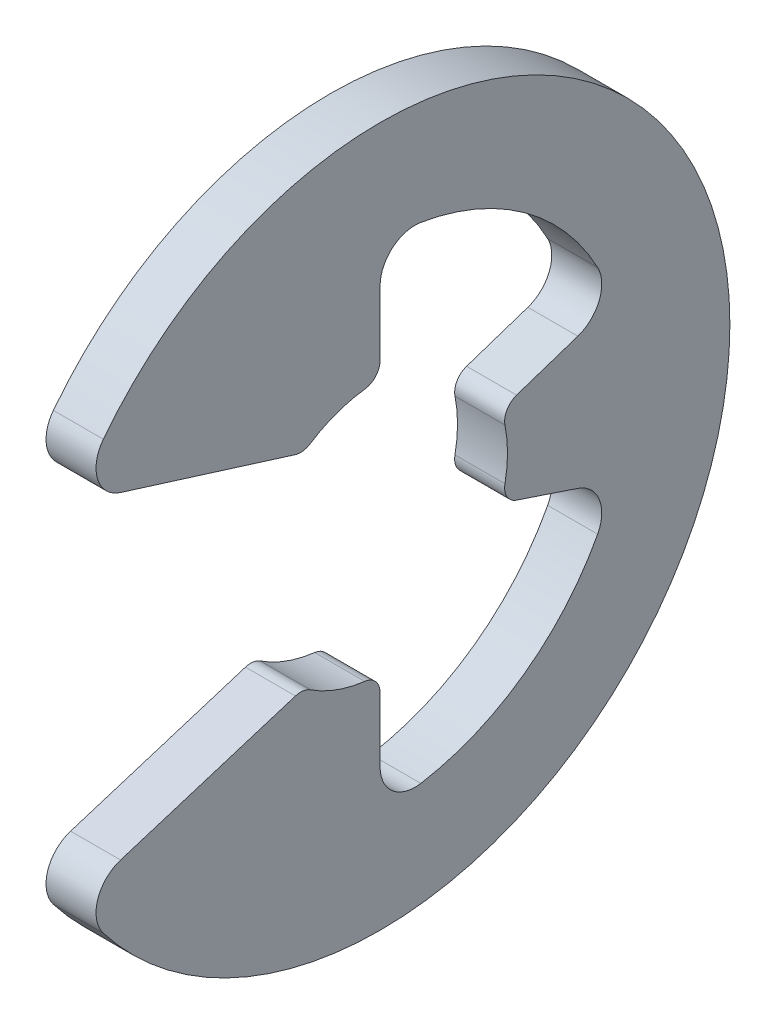
ISO-10303-21;
HEADER;
FILE_DESCRIPTION(('STEP AP214'),'2;1');
FILE_NAME('part.step','',(''),(''),'','','');
FILE_SCHEMA(('AUTOMOTIVE_DESIGN { 1 0 10303 214 1 1 1 1 }'));
ENDSEC;
DATA;
#1=APPLICATION_CONTEXT('core data for automotive mechanical design processes');
#2=APPLICATION_PROTOCOL_DEFINITION('international standard','automotive_design',2000,#1);
#3=PRODUCT_CONTEXT('',#1,'mechanical');
#4=PRODUCT('Part','Part','',(#3));
#5=PRODUCT_RELATED_PRODUCT_CATEGORY('part','',(#4));
#6=PRODUCT_DEFINITION_FORMATION('','',#4);
#7=PRODUCT_DEFINITION_CONTEXT('part definition',#1,'design');
#8=PRODUCT_DEFINITION('design','',#6,#7);
#9=PRODUCT_DEFINITION_SHAPE('','',#8);
#10=(LENGTH_UNIT() NAMED_UNIT(*) SI_UNIT(.MILLI.,.METRE.));
#11=(NAMED_UNIT(*) PLANE_ANGLE_UNIT() SI_UNIT($,.RADIAN.));
#12=(NAMED_UNIT(*) SI_UNIT($,.STERADIAN.) SOLID_ANGLE_UNIT());
#13=UNCERTAINTY_MEASURE_WITH_UNIT(LENGTH_MEASURE(1.E-05),#10,'distance_accuracy_value','');
#14=(GEOMETRIC_REPRESENTATION_CONTEXT(3) GLOBAL_UNCERTAINTY_ASSIGNED_CONTEXT((#13)) GLOBAL_UNIT_ASSIGNED_CONTEXT((#10,
#11,#12)) REPRESENTATION_CONTEXT('',''));
#15=CARTESIAN_POINT('',(0.,0.,0.));
#16=DIRECTION('',(0.,0.,1.));
#17=DIRECTION('',(1.,0.,0.));
#18=AXIS2_PLACEMENT_3D('',#15,#16,#17);
#19=CARTESIAN_POINT('',(0.127,0.,0.));
#20=DIRECTION('',(-1.,0.,0.));
#21=DIRECTION('',(0.,0.,1.));
#22=AXIS2_PLACEMENT_3D('',#19,#20,#21);
#23=CYLINDRICAL_SURFACE('',#22,0.6477);
#24=CARTESIAN_POINT('',(0.127,0.,0.));
#25=DIRECTION('',(-1.,0.,0.));
#26=DIRECTION('',(0.,0.,-1.));
#27=AXIS2_PLACEMENT_3D('',#24,#25,#26);
#28=CIRCLE('',#27,0.6477);
#29=CARTESIAN_POINT('',(0.127,0.129164315793818,-0.63469037295796));
#30=VERTEX_POINT('',#29);
#31=CARTESIAN_POINT('',(0.127,-0.129164315793818,-0.63469037295796));
#32=VERTEX_POINT('',#31);
#33=EDGE_CURVE('E241',#30,#32,#28,.T.);
#34=ORIENTED_EDGE('',*,*,#33,.F.);
#35=DIRECTION('',(-1.,0.,0.));
#36=VECTOR('',#35,1.);
#37=CARTESIAN_POINT('',(0.127,0.129164315793818,-0.634690372957961));
#38=LINE('',#37,#36);
#39=CARTESIAN_POINT('',(-0.127,0.129164315793818,-0.63469037295796));
#40=VERTEX_POINT('',#39);
#41=EDGE_CURVE('E355',#30,#40,#38,.T.);
#42=ORIENTED_EDGE('',*,*,#41,.T.);
#43=CARTESIAN_POINT('',(-0.127,0.,0.));
#44=DIRECTION('',(-1.,0.,0.));
#45=DIRECTION('',(0.,0.,-1.));
#46=AXIS2_PLACEMENT_3D('',#43,#44,#45);
#47=CIRCLE('',#46,0.6477);
#48=CARTESIAN_POINT('',(-0.127,-0.129164315793818,-0.63469037295796));
#49=VERTEX_POINT('',#48);
#50=EDGE_CURVE('E414',#40,#49,#47,.T.);
#51=ORIENTED_EDGE('',*,*,#50,.T.);
#52=DIRECTION('',(-1.,0.,0.));
#53=VECTOR('',#52,1.);
#54=CARTESIAN_POINT('',(0.127,-0.129164315793818,-0.63469037295796));
#55=LINE('',#54,#53);
#56=EDGE_CURVE('E55',#49,#32,#55,.F.);
#57=ORIENTED_EDGE('',*,*,#56,.T.);
#58=EDGE_LOOP('',(#34,#42,#51,#57));
#59=FACE_BOUND('',#58,.T.);
#60=ADVANCED_FACE('F32',(#59),#23,.F.);
#61=CARTESIAN_POINT('',(0.127,-0.204820724049106,-0.614462172147318));
#62=DIRECTION('',(0.,0.948683298050514,-0.316227766016838));
#63=DIRECTION('',(0.,0.316227766016838,0.948683298050514));
#64=AXIS2_PLACEMENT_3D('',#61,#62,#63);
#65=PLANE('',#64);
#66=DIRECTION('',(0.,-0.316227766016838,-0.948683298050514));
#67=VECTOR('',#66,1.);
#68=CARTESIAN_POINT('',(0.127,-0.204820724049106,-0.614462172147318));
#69=LINE('',#68,#67);
#70=CARTESIAN_POINT('',(0.127,-0.231230696491621,-0.693692089474862));
#71=VERTEX_POINT('',#70);
#72=CARTESIAN_POINT('',(0.127,-0.33499811314175,-1.00499433942525));
#73=VERTEX_POINT('',#72);
#74=EDGE_CURVE('E243',#71,#73,#69,.T.);
#75=ORIENTED_EDGE('',*,*,#74,.F.);
#76=DIRECTION('',(-1.,0.,0.));
#77=VECTOR('',#76,1.);
#78=CARTESIAN_POINT('',(0.127,-0.231230696491621,-0.693692089474862));
#79=LINE('',#78,#77);
#80=CARTESIAN_POINT('',(-0.127,-0.231230696491621,-0.693692089474862));
#81=VERTEX_POINT('',#80);
#82=EDGE_CURVE('E360',#71,#81,#79,.T.);
#83=ORIENTED_EDGE('',*,*,#82,.T.);
#84=DIRECTION('',(0.,-0.316227766016838,-0.948683298050514));
#85=VECTOR('',#84,1.);
#86=CARTESIAN_POINT('',(-0.127,-0.204820724049106,-0.614462172147318));
#87=LINE('',#86,#85);
#88=CARTESIAN_POINT('',(-0.127,-0.33499811314175,-1.00499433942525));
#89=VERTEX_POINT('',#88);
#90=EDGE_CURVE('E416',#81,#89,#87,.T.);
#91=ORIENTED_EDGE('',*,*,#90,.T.);
#92=DIRECTION('',(1.,0.,0.));
#93=VECTOR('',#92,1.);
#94=CARTESIAN_POINT('',(0.127,-0.33499811314175,-1.00499433942525));
#95=LINE('',#94,#93);
#96=EDGE_CURVE('E289',#89,#73,#95,.T.);
#97=ORIENTED_EDGE('',*,*,#96,.T.);
#98=EDGE_LOOP('',(#75,#83,#91,#97));
#99=FACE_BOUND('',#98,.T.);
#100=ADVANCED_FACE('F452',(#99),#65,.F.);
#101=CARTESIAN_POINT('',(0.127,0.,0.));
#102=DIRECTION('',(-1.,0.,0.));
#103=DIRECTION('',(0.,0.,1.));
#104=AXIS2_PLACEMENT_3D('',#101,#102,#103);
#105=CYLINDRICAL_SURFACE('',#104,1.25197419354839);
#106=CARTESIAN_POINT('',(-0.127,0.,0.));
#107=DIRECTION('',(-1.,0.,0.));
#108=DIRECTION('',(0.,0.,-1.));
#109=AXIS2_PLACEMENT_3D('',#106,#107,#108);
#110=CIRCLE('',#109,1.25197419354839);
#111=CARTESIAN_POINT('',(-0.127,-0.587043384745752,-1.10581166829501));
#112=VERTEX_POINT('',#111);
#113=CARTESIAN_POINT('',(-0.127,-1.23470447861396,-0.207229900839054));
#114=VERTEX_POINT('',#113);
#115=EDGE_CURVE('E418',#112,#114,#110,.T.);
#116=ORIENTED_EDGE('',*,*,#115,.T.);
#117=DIRECTION('',(-1.,0.,0.));
#118=VECTOR('',#117,1.);
#119=CARTESIAN_POINT('',(0.127,-1.23470447861396,-0.207229900839054));
#120=LINE('',#119,#118);
#121=CARTESIAN_POINT('',(0.127,-1.23470447861396,-0.207229900839054));
#122=VERTEX_POINT('',#121);
#123=EDGE_CURVE('E287',#114,#122,#120,.F.);
#124=ORIENTED_EDGE('',*,*,#123,.T.);
#125=CARTESIAN_POINT('',(0.127,0.,0.));
#126=DIRECTION('',(-1.,0.,0.));
#127=DIRECTION('',(0.,0.,-1.));
#128=AXIS2_PLACEMENT_3D('',#125,#126,#127);
#129=CIRCLE('',#128,1.25197419354839);
#130=CARTESIAN_POINT('',(0.127,-0.587043384745752,-1.10581166829501));
#131=VERTEX_POINT('',#130);
#132=EDGE_CURVE('E245',#131,#122,#129,.T.);
#133=ORIENTED_EDGE('',*,*,#132,.F.);
#134=DIRECTION('',(-1.,0.,0.));
#135=VECTOR('',#134,1.);
#136=CARTESIAN_POINT('',(0.127,-0.587043384745752,-1.10581166829501));
#137=LINE('',#136,#135);
#138=EDGE_CURVE('E284',#131,#112,#137,.T.);
#139=ORIENTED_EDGE('',*,*,#138,.T.);
#140=EDGE_LOOP('',(#116,#124,#133,#139));
#141=FACE_BOUND('',#140,.T.);
#142=ADVANCED_FACE('F457',(#141),#105,.F.);
#143=CARTESIAN_POINT('',(0.127,-1.25197419354839,0.));
#144=DIRECTION('',(0.,0.,1.));
#145=DIRECTION('',(0.,-1.,0.));
#146=AXIS2_PLACEMENT_3D('',#143,#144,#145);
#147=PLANE('',#146);
#148=DIRECTION('',(0.,1.,0.));
#149=VECTOR('',#148,1.);
#150=CARTESIAN_POINT('',(-0.127,-1.25197419354839,0.));
#151=LINE('',#150,#149);
#152=CARTESIAN_POINT('',(-0.127,-1.05935704938672,0.));
#153=VERTEX_POINT('',#152);
#154=CARTESIAN_POINT('',(-0.127,-0.731215665860627,0.));
#155=VERTEX_POINT('',#154);
#156=EDGE_CURVE('E423',#153,#155,#151,.T.);
#157=ORIENTED_EDGE('',*,*,#156,.T.);
#158=DIRECTION('',(-1.,0.,0.));
#159=VECTOR('',#158,1.);
#160=CARTESIAN_POINT('',(0.127,-0.731215665860627,0.));
#161=LINE('',#160,#159);
#162=CARTESIAN_POINT('',(0.127,-0.731215665860627,0.));
#163=VERTEX_POINT('',#162);
#164=EDGE_CURVE('E338',#155,#163,#161,.F.);
#165=ORIENTED_EDGE('',*,*,#164,.T.);
#166=DIRECTION('',(0.,1.,0.));
#167=VECTOR('',#166,1.);
#168=CARTESIAN_POINT('',(0.127,-1.25197419354839,0.));
#169=LINE('',#168,#167);
#170=CARTESIAN_POINT('',(0.127,-1.05935704938672,0.));
#171=VERTEX_POINT('',#170);
#172=EDGE_CURVE('E248',#171,#163,#169,.T.);
#173=ORIENTED_EDGE('',*,*,#172,.F.);
#174=DIRECTION('',(1.,0.,0.));
#175=VECTOR('',#174,1.);
#176=CARTESIAN_POINT('',(-0.127,-1.05935704938672,0.));
#177=LINE('',#176,#175);
#178=EDGE_CURVE('E281',#171,#153,#177,.F.);
#179=ORIENTED_EDGE('',*,*,#178,.T.);
#180=EDGE_LOOP('',(#157,#165,#173,#179));
#181=FACE_BOUND('',#180,.T.);
#182=ADVANCED_FACE('F463',(#181),#147,.F.);
#183=CARTESIAN_POINT('',(0.127,0.,0.));
#184=DIRECTION('',(-1.,0.,0.));
#185=DIRECTION('',(0.,0.,1.));
#186=AXIS2_PLACEMENT_3D('',#183,#184,#185);
#187=CYLINDRICAL_SURFACE('',#186,0.6477);
#188=CARTESIAN_POINT('',(0.127,0.,0.));
#189=DIRECTION('',(-1.,0.,0.));
#190=DIRECTION('',(0.,0.,-1.));
#191=AXIS2_PLACEMENT_3D('',#188,#189,#190);
#192=CIRCLE('',#191,0.6477);
#193=CARTESIAN_POINT('',(0.127,-0.642965499291241,0.0781706896551725));
#194=VERTEX_POINT('',#193);
#195=CARTESIAN_POINT('',(0.127,-0.541693915280569,0.355081669687423));
#196=VERTEX_POINT('',#195);
#197=EDGE_CURVE('E251',#194,#196,#192,.T.);
#198=ORIENTED_EDGE('',*,*,#197,.F.);
#199=DIRECTION('',(-1.,0.,0.));
#200=VECTOR('',#199,1.);
#201=CARTESIAN_POINT('',(0.127,-0.642965499291241,0.0781706896551726));
#202=LINE('',#201,#200);
#203=CARTESIAN_POINT('',(-0.127,-0.642965499291241,0.0781706896551725));
#204=VERTEX_POINT('',#203);
#205=EDGE_CURVE('E323',#194,#204,#202,.T.);
#206=ORIENTED_EDGE('',*,*,#205,.T.);
#207=CARTESIAN_POINT('',(-0.127,0.,0.));
#208=DIRECTION('',(-1.,0.,0.));
#209=DIRECTION('',(0.,0.,-1.));
#210=AXIS2_PLACEMENT_3D('',#207,#208,#209);
#211=CIRCLE('',#210,0.6477);
#212=CARTESIAN_POINT('',(-0.127,-0.541693915280569,0.355081669687423));
#213=VERTEX_POINT('',#212);
#214=EDGE_CURVE('E227',#204,#213,#211,.T.);
#215=ORIENTED_EDGE('',*,*,#214,.T.);
#216=DIRECTION('',(-1.,0.,0.));
#217=VECTOR('',#216,1.);
#218=CARTESIAN_POINT('',(0.127,-0.541693915280569,0.355081669687423));
#219=LINE('',#218,#217);
#220=EDGE_CURVE('E321',#213,#196,#219,.F.);
#221=ORIENTED_EDGE('',*,*,#220,.T.);
#222=EDGE_LOOP('',(#198,#206,#215,#221));
#223=FACE_BOUND('',#222,.T.);
#224=ADVANCED_FACE('F429',(#223),#187,.F.);
#225=CARTESIAN_POINT('',(0.127,-0.51816,0.38862));
#226=DIRECTION('',(0.,-0.954513538836348,-0.29816757734219));
#227=DIRECTION('',(0.,0.29816757734219,-0.954513538836348));
#228=AXIS2_PLACEMENT_3D('',#225,#226,#227);
#229=PLANE('',#228);
#230=DIRECTION('',(0.,-0.29816757734219,0.954513538836348));
#231=VECTOR('',#230,1.);
#232=CARTESIAN_POINT('',(0.127,-0.51816,0.38862));
#233=LINE('',#232,#231);
#234=CARTESIAN_POINT('',(0.127,-0.531187806912605,0.430325467074162));
#235=VERTEX_POINT('',#234);
#236=CARTESIAN_POINT('',(0.127,-0.808834054460641,1.31914478356062));
#237=VERTEX_POINT('',#236);
#238=EDGE_CURVE('E254',#235,#237,#233,.T.);
#239=ORIENTED_EDGE('',*,*,#238,.F.);
#240=DIRECTION('',(-1.,0.,0.));
#241=VECTOR('',#240,1.);
#242=CARTESIAN_POINT('',(0.127,-0.531187806912605,0.430325467074162));
#243=LINE('',#242,#241);
#244=CARTESIAN_POINT('',(-0.127,-0.531187806912605,0.430325467074162));
#245=VERTEX_POINT('',#244);
#246=EDGE_CURVE('E351',#235,#245,#243,.T.);
#247=ORIENTED_EDGE('',*,*,#246,.T.);
#248=DIRECTION('',(0.,-0.29816757734219,0.954513538836348));
#249=VECTOR('',#248,1.);
#250=CARTESIAN_POINT('',(-0.127,-0.51816,0.38862));
#251=LINE('',#250,#249);
#252=CARTESIAN_POINT('',(-0.127,-0.808834054460641,1.31914478356062));
#253=VERTEX_POINT('',#252);
#254=EDGE_CURVE('E222',#245,#253,#251,.T.);
#255=ORIENTED_EDGE('',*,*,#254,.T.);
#256=DIRECTION('',(-1.,0.,0.));
#257=VECTOR('',#256,1.);
#258=CARTESIAN_POINT('',(0.127,-0.808834054460641,1.31914478356062));
#259=LINE('',#258,#257);
#260=EDGE_CURVE('E202',#253,#237,#259,.F.);
#261=ORIENTED_EDGE('',*,*,#260,.T.);
#262=EDGE_LOOP('',(#239,#247,#255,#261));
#263=FACE_BOUND('',#262,.T.);
#264=ADVANCED_FACE('F437',(#263),#229,.F.);
#265=CARTESIAN_POINT('',(0.127,0.,0.));
#266=DIRECTION('',(-1.,0.,0.));
#267=DIRECTION('',(0.,0.,1.));
#268=AXIS2_PLACEMENT_3D('',#265,#266,#267);
#269=CYLINDRICAL_SURFACE('',#268,1.778);
#270=CARTESIAN_POINT('',(0.127,0.,0.));
#271=DIRECTION('',(1.,0.,0.));
#272=DIRECTION('',(0.,0.,-1.));
#273=AXIS2_PLACEMENT_3D('',#270,#271,#272);
#274=CIRCLE('',#273,1.778);
#275=CARTESIAN_POINT('',(0.127,-1.08727395740638,1.40681176478798));
#276=VERTEX_POINT('',#275);
#277=CARTESIAN_POINT('',(0.127,1.08727395740638,1.40681176478798));
#278=VERTEX_POINT('',#277);
#279=EDGE_CURVE('E215',#276,#278,#274,.T.);
#280=ORIENTED_EDGE('',*,*,#279,.F.);
#281=DIRECTION('',(-1.,0.,0.));
#282=VECTOR('',#281,1.);
#283=CARTESIAN_POINT('',(0.127,-1.08727395740638,1.40681176478798));
#284=LINE('',#283,#282);
#285=CARTESIAN_POINT('',(-0.127,-1.08727395740638,1.40681176478798));
#286=VERTEX_POINT('',#285);
#287=EDGE_CURVE('E200',#276,#286,#284,.T.);
#288=ORIENTED_EDGE('',*,*,#287,.T.);
#289=CARTESIAN_POINT('',(-0.127,0.,0.));
#290=DIRECTION('',(1.,0.,0.));
#291=DIRECTION('',(0.,0.,-1.));
#292=AXIS2_PLACEMENT_3D('',#289,#290,#291);
#293=CIRCLE('',#292,1.778);
#294=CARTESIAN_POINT('',(-0.127,1.08727395740638,1.40681176478798));
#295=VERTEX_POINT('',#294);
#296=EDGE_CURVE('E212',#286,#295,#293,.T.);
#297=ORIENTED_EDGE('',*,*,#296,.T.);
#298=DIRECTION('',(-1.,0.,0.));
#299=VECTOR('',#298,1.);
#300=CARTESIAN_POINT('',(0.127,1.08727395740638,1.40681176478798));
#301=LINE('',#300,#299);
#302=EDGE_CURVE('E216',#295,#278,#301,.F.);
#303=ORIENTED_EDGE('',*,*,#302,.T.);
#304=EDGE_LOOP('',(#280,#288,#297,#303));
#305=FACE_BOUND('',#304,.T.);
#306=ADVANCED_FACE('F211',(#305),#269,.T.);
#307=CARTESIAN_POINT('',(0.127,0.879466537283357,1.54525810458927));
#308=DIRECTION('',(0.,0.954513538836349,-0.298167577342189));
#309=DIRECTION('',(0.,0.298167577342189,0.954513538836349));
#310=AXIS2_PLACEMENT_3D('',#307,#308,#309);
#311=PLANE('',#310);
#312=DIRECTION('',(0.,-0.298167577342189,-0.954513538836349));
#313=VECTOR('',#312,1.);
#314=CARTESIAN_POINT('',(-0.127,0.879466537283357,1.54525810458927));
#315=LINE('',#314,#313);
#316=CARTESIAN_POINT('',(-0.127,0.80883405446064,1.31914478356062));
#317=VERTEX_POINT('',#316);
#318=CARTESIAN_POINT('',(-0.127,0.531187806912605,0.430325467074163));
#319=VERTEX_POINT('',#318);
#320=EDGE_CURVE('E221',#317,#319,#315,.T.);
#321=ORIENTED_EDGE('',*,*,#320,.T.);
#322=DIRECTION('',(-1.,0.,0.));
#323=VECTOR('',#322,1.);
#324=CARTESIAN_POINT('',(0.127,0.531187806912605,0.430325467074163));
#325=LINE('',#324,#323);
#326=CARTESIAN_POINT('',(0.127,0.531187806912605,0.430325467074163));
#327=VERTEX_POINT('',#326);
#328=EDGE_CURVE('E40',#319,#327,#325,.F.);
#329=ORIENTED_EDGE('',*,*,#328,.T.);
#330=DIRECTION('',(0.,-0.298167577342189,-0.954513538836349));
#331=VECTOR('',#330,1.);
#332=CARTESIAN_POINT('',(0.127,0.879466537283357,1.54525810458927));
#333=LINE('',#332,#331);
#334=CARTESIAN_POINT('',(0.127,0.80883405446064,1.31914478356062));
#335=VERTEX_POINT('',#334);
#336=EDGE_CURVE('E257',#335,#327,#333,.T.);
#337=ORIENTED_EDGE('',*,*,#336,.F.);
#338=DIRECTION('',(-1.,0.,0.));
#339=VECTOR('',#338,1.);
#340=CARTESIAN_POINT('',(0.127,0.80883405446064,1.31914478356062));
#341=LINE('',#340,#339);
#342=EDGE_CURVE('E278',#335,#317,#341,.T.);
#343=ORIENTED_EDGE('',*,*,#342,.T.);
#344=EDGE_LOOP('',(#321,#329,#337,#343));
#345=FACE_BOUND('',#344,.T.);
#346=ADVANCED_FACE('F370',(#345),#311,.F.);
#347=CARTESIAN_POINT('',(0.127,0.,0.));
#348=DIRECTION('',(-1.,0.,0.));
#349=DIRECTION('',(0.,0.,1.));
#350=AXIS2_PLACEMENT_3D('',#347,#348,#349);
#351=CYLINDRICAL_SURFACE('',#350,0.6477);
#352=CARTESIAN_POINT('',(0.127,0.,0.));
#353=DIRECTION('',(-1.,0.,0.));
#354=DIRECTION('',(0.,0.,-1.));
#355=AXIS2_PLACEMENT_3D('',#352,#353,#354);
#356=CIRCLE('',#355,0.6477);
#357=CARTESIAN_POINT('',(0.127,0.541693915280569,0.355081669687423));
#358=VERTEX_POINT('',#357);
#359=CARTESIAN_POINT('',(0.127,0.642965499291241,0.0781706896551728));
#360=VERTEX_POINT('',#359);
#361=EDGE_CURVE('E260',#358,#360,#356,.T.);
#362=ORIENTED_EDGE('',*,*,#361,.F.);
#363=DIRECTION('',(-1.,0.,0.));
#364=VECTOR('',#363,1.);
#365=CARTESIAN_POINT('',(0.127,0.541693915280569,0.355081669687423));
#366=LINE('',#365,#364);
#367=CARTESIAN_POINT('',(-0.127,0.541693915280569,0.355081669687423));
#368=VERTEX_POINT('',#367);
#369=EDGE_CURVE('E365',#358,#368,#366,.T.);
#370=ORIENTED_EDGE('',*,*,#369,.T.);
#371=CARTESIAN_POINT('',(-0.127,0.,0.));
#372=DIRECTION('',(-1.,0.,0.));
#373=DIRECTION('',(0.,0.,-1.));
#374=AXIS2_PLACEMENT_3D('',#371,#372,#373);
#375=CIRCLE('',#374,0.6477);
#376=CARTESIAN_POINT('',(-0.127,0.642965499291241,0.0781706896551728));
#377=VERTEX_POINT('',#376);
#378=EDGE_CURVE('E225',#368,#377,#375,.T.);
#379=ORIENTED_EDGE('',*,*,#378,.T.);
#380=DIRECTION('',(-1.,0.,0.));
#381=VECTOR('',#380,1.);
#382=CARTESIAN_POINT('',(0.127,0.642965499291241,0.0781706896551728));
#383=LINE('',#382,#381);
#384=EDGE_CURVE('E363',#377,#360,#383,.F.);
#385=ORIENTED_EDGE('',*,*,#384,.T.);
#386=EDGE_LOOP('',(#362,#370,#379,#385));
#387=FACE_BOUND('',#386,.T.);
#388=ADVANCED_FACE('F381',(#387),#351,.F.);
#389=CARTESIAN_POINT('',(0.127,0.6477,0.));
#390=DIRECTION('',(0.,0.,1.));
#391=DIRECTION('',(0.,-1.,0.));
#392=AXIS2_PLACEMENT_3D('',#389,#390,#391);
#393=PLANE('',#392);
#394=DIRECTION('',(0.,1.,0.));
#395=VECTOR('',#394,1.);
#396=CARTESIAN_POINT('',(0.127,0.6477,0.));
#397=LINE('',#396,#395);
#398=CARTESIAN_POINT('',(0.127,0.731215665860627,0.));
#399=VERTEX_POINT('',#398);
#400=CARTESIAN_POINT('',(0.127,1.05935704938672,0.));
#401=VERTEX_POINT('',#400);
#402=EDGE_CURVE('E263',#399,#401,#397,.T.);
#403=ORIENTED_EDGE('',*,*,#402,.F.);
#404=DIRECTION('',(-1.,0.,0.));
#405=VECTOR('',#404,1.);
#406=CARTESIAN_POINT('',(0.127,0.731215665860627,0.));
#407=LINE('',#406,#405);
#408=CARTESIAN_POINT('',(-0.127,0.731215665860627,0.));
#409=VERTEX_POINT('',#408);
#410=EDGE_CURVE('E11',#399,#409,#407,.T.);
#411=ORIENTED_EDGE('',*,*,#410,.T.);
#412=DIRECTION('',(0.,1.,0.));
#413=VECTOR('',#412,1.);
#414=CARTESIAN_POINT('',(-0.127,0.6477,0.));
#415=LINE('',#414,#413);
#416=CARTESIAN_POINT('',(-0.127,1.05935704938672,0.));
#417=VERTEX_POINT('',#416);
#418=EDGE_CURVE('E233',#409,#417,#415,.T.);
#419=ORIENTED_EDGE('',*,*,#418,.T.);
#420=DIRECTION('',(1.,0.,0.));
#421=VECTOR('',#420,1.);
#422=CARTESIAN_POINT('',(0.127,1.05935704938672,0.));
#423=LINE('',#422,#421);
#424=EDGE_CURVE('E300',#417,#401,#423,.T.);
#425=ORIENTED_EDGE('',*,*,#424,.T.);
#426=EDGE_LOOP('',(#403,#411,#419,#425));
#427=FACE_BOUND('',#426,.T.);
#428=ADVANCED_FACE('F389',(#427),#393,.F.);
#429=CARTESIAN_POINT('',(0.127,0.,0.));
#430=DIRECTION('',(-1.,0.,0.));
#431=DIRECTION('',(0.,0.,1.));
#432=AXIS2_PLACEMENT_3D('',#429,#430,#431);
#433=CYLINDRICAL_SURFACE('',#432,1.25197419354839);
#434=CARTESIAN_POINT('',(-0.127,0.,0.));
#435=DIRECTION('',(-1.,0.,0.));
#436=DIRECTION('',(0.,0.,-1.));
#437=AXIS2_PLACEMENT_3D('',#434,#435,#436);
#438=CIRCLE('',#437,1.25197419354839);
#439=CARTESIAN_POINT('',(-0.127,1.23470447861396,-0.207229900839054));
#440=VERTEX_POINT('',#439);
#441=CARTESIAN_POINT('',(-0.127,0.587043384745752,-1.10581166829501));
#442=VERTEX_POINT('',#441);
#443=EDGE_CURVE('E235',#440,#442,#438,.T.);
#444=ORIENTED_EDGE('',*,*,#443,.T.);
#445=DIRECTION('',(-1.,0.,0.));
#446=VECTOR('',#445,1.);
#447=CARTESIAN_POINT('',(0.127,0.587043384745752,-1.10581166829501));
#448=LINE('',#447,#446);
#449=CARTESIAN_POINT('',(0.127,0.587043384745752,-1.10581166829501));
#450=VERTEX_POINT('',#449);
#451=EDGE_CURVE('E298',#442,#450,#448,.F.);
#452=ORIENTED_EDGE('',*,*,#451,.T.);
#453=CARTESIAN_POINT('',(0.127,0.,0.));
#454=DIRECTION('',(-1.,0.,0.));
#455=DIRECTION('',(0.,0.,-1.));
#456=AXIS2_PLACEMENT_3D('',#453,#454,#455);
#457=CIRCLE('',#456,1.25197419354839);
#458=CARTESIAN_POINT('',(0.127,1.23470447861396,-0.207229900839054));
#459=VERTEX_POINT('',#458);
#460=EDGE_CURVE('E265',#459,#450,#457,.T.);
#461=ORIENTED_EDGE('',*,*,#460,.F.);
#462=DIRECTION('',(-1.,0.,0.));
#463=VECTOR('',#462,1.);
#464=CARTESIAN_POINT('',(0.127,1.23470447861396,-0.207229900839054));
#465=LINE('',#464,#463);
#466=EDGE_CURVE('E295',#459,#440,#465,.T.);
#467=ORIENTED_EDGE('',*,*,#466,.T.);
#468=EDGE_LOOP('',(#444,#452,#461,#467));
#469=FACE_BOUND('',#468,.T.);
#470=ADVANCED_FACE('F397',(#469),#433,.F.);
#471=CARTESIAN_POINT('',(0.127,0.395909002336539,-1.18772700700962));
#472=DIRECTION('',(0.,-0.948683298050514,-0.316227766016838));
#473=DIRECTION('',(0.,0.316227766016838,-0.948683298050514));
#474=AXIS2_PLACEMENT_3D('',#471,#472,#473);
#475=PLANE('',#474);
#476=DIRECTION('',(0.,-0.316227766016838,0.948683298050514));
#477=VECTOR('',#476,1.);
#478=CARTESIAN_POINT('',(-0.127,0.395909002336539,-1.18772700700962));
#479=LINE('',#478,#477);
#480=CARTESIAN_POINT('',(-0.127,0.33499811314175,-1.00499433942525));
#481=VERTEX_POINT('',#480);
#482=CARTESIAN_POINT('',(-0.127,0.231230696491621,-0.693692089474862));
#483=VERTEX_POINT('',#482);
#484=EDGE_CURVE('E238',#481,#483,#479,.T.);
#485=ORIENTED_EDGE('',*,*,#484,.T.);
#486=DIRECTION('',(-1.,0.,0.));
#487=VECTOR('',#486,1.);
#488=CARTESIAN_POINT('',(0.127,0.231230696491621,-0.693692089474862));
#489=LINE('',#488,#487);
#490=CARTESIAN_POINT('',(0.127,0.231230696491621,-0.693692089474862));
#491=VERTEX_POINT('',#490);
#492=EDGE_CURVE('E358',#483,#491,#489,.F.);
#493=ORIENTED_EDGE('',*,*,#492,.T.);
#494=DIRECTION('',(0.,-0.316227766016838,0.948683298050514));
#495=VECTOR('',#494,1.);
#496=CARTESIAN_POINT('',(0.127,0.395909002336539,-1.18772700700962));
#497=LINE('',#496,#495);
#498=CARTESIAN_POINT('',(0.127,0.33499811314175,-1.00499433942525));
#499=VERTEX_POINT('',#498);
#500=EDGE_CURVE('E268',#499,#491,#497,.T.);
#501=ORIENTED_EDGE('',*,*,#500,.F.);
#502=DIRECTION('',(1.,0.,0.));
#503=VECTOR('',#502,1.);
#504=CARTESIAN_POINT('',(-0.127,0.33499811314175,-1.00499433942525));
#505=LINE('',#504,#503);
#506=EDGE_CURVE('E292',#499,#481,#505,.F.);
#507=ORIENTED_EDGE('',*,*,#506,.T.);
#508=EDGE_LOOP('',(#485,#493,#501,#507));
#509=FACE_BOUND('',#508,.T.);
#510=ADVANCED_FACE('F408',(#509),#475,.F.);
#511=CARTESIAN_POINT('',(0.127,0.,0.));
#512=DIRECTION('',(1.,0.,0.));
#513=DIRECTION('',(0.,0.,-1.));
#514=AXIS2_PLACEMENT_3D('',#511,#512,#513);
#515=PLANE('',#514);
#516=ORIENTED_EDGE('',*,*,#172,.T.);
#517=CARTESIAN_POINT('',(0.127,-0.731215665860627,0.0889000000000002));
#518=DIRECTION('',(1.,0.,0.));
#519=DIRECTION('',(0.,0.,-1.));
#520=AXIS2_PLACEMENT_3D('',#517,#518,#519);
#521=CIRCLE('',#520,0.0889);
#522=EDGE_CURVE('E349',#163,#194,#521,.T.);
#523=ORIENTED_EDGE('',*,*,#522,.T.);
#524=ORIENTED_EDGE('',*,*,#197,.T.);
#525=CARTESIAN_POINT('',(0.127,-0.616044060515156,0.403818369448442));
#526=DIRECTION('',(1.,0.,0.));
#527=DIRECTION('',(0.,0.,-1.));
#528=AXIS2_PLACEMENT_3D('',#525,#526,#527);
#529=CIRCLE('',#528,0.0889);
#530=EDGE_CURVE('E347',#196,#235,#529,.T.);
#531=ORIENTED_EDGE('',*,*,#530,.T.);
#532=ORIENTED_EDGE('',*,*,#238,.T.);
#533=CARTESIAN_POINT('',(0.127,-0.978546561665743,1.26613058830918));
#534=DIRECTION('',(1.,0.,0.));
#535=DIRECTION('',(0.,0.,-1.));
#536=AXIS2_PLACEMENT_3D('',#533,#534,#535);
#537=CIRCLE('',#536,0.1778);
#538=EDGE_CURVE('E276',#237,#276,#537,.T.);
#539=ORIENTED_EDGE('',*,*,#538,.T.);
#540=ORIENTED_EDGE('',*,*,#279,.T.);
#541=CARTESIAN_POINT('',(0.127,0.978546561665743,1.26613058830918));
#542=DIRECTION('',(1.,0.,0.));
#543=DIRECTION('',(0.,0.,-1.));
#544=AXIS2_PLACEMENT_3D('',#541,#542,#543);
#545=CIRCLE('',#544,0.1778);
#546=EDGE_CURVE('E274',#278,#335,#545,.T.);
#547=ORIENTED_EDGE('',*,*,#546,.T.);
#548=ORIENTED_EDGE('',*,*,#336,.T.);
#549=CARTESIAN_POINT('',(0.127,0.616044060515156,0.403818369448442));
#550=DIRECTION('',(1.,0.,0.));
#551=DIRECTION('',(0.,0.,-1.));
#552=AXIS2_PLACEMENT_3D('',#549,#550,#551);
#553=CIRCLE('',#552,0.0889);
#554=EDGE_CURVE('E342',#327,#358,#553,.T.);
#555=ORIENTED_EDGE('',*,*,#554,.T.);
#556=ORIENTED_EDGE('',*,*,#361,.T.);
#557=CARTESIAN_POINT('',(0.127,0.731215665860627,0.0889000000000004));
#558=DIRECTION('',(1.,0.,0.));
#559=DIRECTION('',(0.,0.,-1.));
#560=AXIS2_PLACEMENT_3D('',#557,#558,#559);
#561=CIRCLE('',#560,0.0889);
#562=EDGE_CURVE('E340',#360,#399,#561,.T.);
#563=ORIENTED_EDGE('',*,*,#562,.T.);
#564=ORIENTED_EDGE('',*,*,#402,.T.);
#565=CARTESIAN_POINT('',(0.127,1.05935704938672,-0.1778));
#566=DIRECTION('',(1.,0.,0.));
#567=DIRECTION('',(0.,0.,-1.));
#568=AXIS2_PLACEMENT_3D('',#565,#566,#567);
#569=CIRCLE('',#568,0.1778);
#570=EDGE_CURVE('E319',#401,#459,#569,.F.);
#571=ORIENTED_EDGE('',*,*,#570,.T.);
#572=ORIENTED_EDGE('',*,*,#460,.T.);
#573=CARTESIAN_POINT('',(0.127,0.503674003535132,-0.948769042627456));
#574=DIRECTION('',(1.,0.,0.));
#575=DIRECTION('',(0.,0.,-1.));
#576=AXIS2_PLACEMENT_3D('',#573,#574,#575);
#577=CIRCLE('',#576,0.1778);
#578=EDGE_CURVE('E314',#450,#499,#577,.F.);
#579=ORIENTED_EDGE('',*,*,#578,.T.);
#580=ORIENTED_EDGE('',*,*,#500,.T.);
#581=CARTESIAN_POINT('',(0.127,0.14689275129493,-0.721804737873759));
#582=DIRECTION('',(1.,0.,0.));
#583=DIRECTION('',(0.,0.,-1.));
#584=AXIS2_PLACEMENT_3D('',#581,#582,#583);
#585=CIRCLE('',#584,0.0889);
#586=EDGE_CURVE('E345',#491,#30,#585,.T.);
#587=ORIENTED_EDGE('',*,*,#586,.T.);
#588=ORIENTED_EDGE('',*,*,#33,.T.);
#589=CARTESIAN_POINT('',(0.127,-0.14689275129493,-0.721804737873759));
#590=DIRECTION('',(1.,0.,0.));
#591=DIRECTION('',(0.,0.,-1.));
#592=AXIS2_PLACEMENT_3D('',#589,#590,#591);
#593=CIRCLE('',#592,0.0889);
#594=EDGE_CURVE('E47',#32,#71,#593,.T.);
#595=ORIENTED_EDGE('',*,*,#594,.T.);
#596=ORIENTED_EDGE('',*,*,#74,.T.);
#597=CARTESIAN_POINT('',(0.127,-0.503674003535131,-0.948769042627456));
#598=DIRECTION('',(1.,0.,0.));
#599=DIRECTION('',(0.,0.,-1.));
#600=AXIS2_PLACEMENT_3D('',#597,#598,#599);
#601=CIRCLE('',#600,0.1778);
#602=EDGE_CURVE('E310',#73,#131,#601,.F.);
#603=ORIENTED_EDGE('',*,*,#602,.T.);
#604=ORIENTED_EDGE('',*,*,#132,.T.);
#605=CARTESIAN_POINT('',(0.127,-1.05935704938672,-0.1778));
#606=DIRECTION('',(1.,0.,0.));
#607=DIRECTION('',(0.,0.,-1.));
#608=AXIS2_PLACEMENT_3D('',#605,#606,#607);
#609=CIRCLE('',#608,0.1778);
#610=EDGE_CURVE('E305',#122,#171,#609,.F.);
#611=ORIENTED_EDGE('',*,*,#610,.T.);
#612=EDGE_LOOP('',(#516,#523,#524,#531,#532,#539,#540,#547,#548,#555,#556,#563,#564,#571,#572,
#579,#580,#587,#588,#595,#596,#603,#604,#611));
#613=FACE_BOUND('',#612,.T.);
#614=ADVANCED_FACE('F374',(#613),#515,.T.);
#615=CARTESIAN_POINT('',(-0.127,0.,0.));
#616=DIRECTION('',(1.,0.,0.));
#617=DIRECTION('',(0.,0.,-1.));
#618=AXIS2_PLACEMENT_3D('',#615,#616,#617);
#619=PLANE('',#618);
#620=ORIENTED_EDGE('',*,*,#214,.F.);
#621=CARTESIAN_POINT('',(-0.127,-0.731215665860627,0.0889000000000002));
#622=DIRECTION('',(1.,0.,0.));
#623=DIRECTION('',(0.,0.,-1.));
#624=AXIS2_PLACEMENT_3D('',#621,#622,#623);
#625=CIRCLE('',#624,0.0889);
#626=EDGE_CURVE('E336',#204,#155,#625,.F.);
#627=ORIENTED_EDGE('',*,*,#626,.T.);
#628=ORIENTED_EDGE('',*,*,#156,.F.);
#629=CARTESIAN_POINT('',(-0.127,-1.05935704938672,-0.1778));
#630=DIRECTION('',(1.,0.,0.));
#631=DIRECTION('',(0.,0.,-1.));
#632=AXIS2_PLACEMENT_3D('',#629,#630,#631);
#633=CIRCLE('',#632,0.1778);
#634=EDGE_CURVE('E303',#153,#114,#633,.T.);
#635=ORIENTED_EDGE('',*,*,#634,.T.);
#636=ORIENTED_EDGE('',*,*,#115,.F.);
#637=CARTESIAN_POINT('',(-0.127,-0.503674003535131,-0.948769042627456));
#638=DIRECTION('',(1.,0.,0.));
#639=DIRECTION('',(0.,0.,-1.));
#640=AXIS2_PLACEMENT_3D('',#637,#638,#639);
#641=CIRCLE('',#640,0.1778);
#642=EDGE_CURVE('E307',#112,#89,#641,.T.);
#643=ORIENTED_EDGE('',*,*,#642,.T.);
#644=ORIENTED_EDGE('',*,*,#90,.F.);
#645=CARTESIAN_POINT('',(-0.127,-0.14689275129493,-0.721804737873759));
#646=DIRECTION('',(1.,0.,0.));
#647=DIRECTION('',(0.,0.,-1.));
#648=AXIS2_PLACEMENT_3D('',#645,#646,#647);
#649=CIRCLE('',#648,0.0889);
#650=EDGE_CURVE('E330',#81,#49,#649,.F.);
#651=ORIENTED_EDGE('',*,*,#650,.T.);
#652=ORIENTED_EDGE('',*,*,#50,.F.);
#653=CARTESIAN_POINT('',(-0.127,0.14689275129493,-0.721804737873759));
#654=DIRECTION('',(1.,0.,0.));
#655=DIRECTION('',(0.,0.,-1.));
#656=AXIS2_PLACEMENT_3D('',#653,#654,#655);
#657=CIRCLE('',#656,0.0889);
#658=EDGE_CURVE('E332',#40,#483,#657,.F.);
#659=ORIENTED_EDGE('',*,*,#658,.T.);
#660=ORIENTED_EDGE('',*,*,#484,.F.);
#661=CARTESIAN_POINT('',(-0.127,0.503674003535132,-0.948769042627456));
#662=DIRECTION('',(1.,0.,0.));
#663=DIRECTION('',(0.,0.,-1.));
#664=AXIS2_PLACEMENT_3D('',#661,#662,#663);
#665=CIRCLE('',#664,0.1778);
#666=EDGE_CURVE('E312',#481,#442,#665,.T.);
#667=ORIENTED_EDGE('',*,*,#666,.T.);
#668=ORIENTED_EDGE('',*,*,#443,.F.);
#669=CARTESIAN_POINT('',(-0.127,1.05935704938672,-0.1778));
#670=DIRECTION('',(1.,0.,0.));
#671=DIRECTION('',(0.,0.,-1.));
#672=AXIS2_PLACEMENT_3D('',#669,#670,#671);
#673=CIRCLE('',#672,0.1778);
#674=EDGE_CURVE('E316',#440,#417,#673,.T.);
#675=ORIENTED_EDGE('',*,*,#674,.T.);
#676=ORIENTED_EDGE('',*,*,#418,.F.);
#677=CARTESIAN_POINT('',(-0.127,0.731215665860627,0.0889000000000004));
#678=DIRECTION('',(1.,0.,0.));
#679=DIRECTION('',(0.,0.,-1.));
#680=AXIS2_PLACEMENT_3D('',#677,#678,#679);
#681=CIRCLE('',#680,0.0889);
#682=EDGE_CURVE('E326',#409,#377,#681,.F.);
#683=ORIENTED_EDGE('',*,*,#682,.T.);
#684=ORIENTED_EDGE('',*,*,#378,.F.);
#685=CARTESIAN_POINT('',(-0.127,0.616044060515156,0.403818369448442));
#686=DIRECTION('',(1.,0.,0.));
#687=DIRECTION('',(0.,0.,-1.));
#688=AXIS2_PLACEMENT_3D('',#685,#686,#687);
#689=CIRCLE('',#688,0.0889);
#690=EDGE_CURVE('E328',#368,#319,#689,.F.);
#691=ORIENTED_EDGE('',*,*,#690,.T.);
#692=ORIENTED_EDGE('',*,*,#320,.F.);
#693=CARTESIAN_POINT('',(-0.127,0.978546561665743,1.26613058830918));
#694=DIRECTION('',(1.,0.,0.));
#695=DIRECTION('',(0.,0.,-1.));
#696=AXIS2_PLACEMENT_3D('',#693,#694,#695);
#697=CIRCLE('',#696,0.1778);
#698=EDGE_CURVE('E206',#317,#295,#697,.F.);
#699=ORIENTED_EDGE('',*,*,#698,.T.);
#700=ORIENTED_EDGE('',*,*,#296,.F.);
#701=CARTESIAN_POINT('',(-0.127,-0.978546561665743,1.26613058830918));
#702=DIRECTION('',(1.,0.,0.));
#703=DIRECTION('',(0.,0.,-1.));
#704=AXIS2_PLACEMENT_3D('',#701,#702,#703);
#705=CIRCLE('',#704,0.1778);
#706=EDGE_CURVE('E196',#286,#253,#705,.F.);
#707=ORIENTED_EDGE('',*,*,#706,.T.);
#708=ORIENTED_EDGE('',*,*,#254,.F.);
#709=CARTESIAN_POINT('',(-0.127,-0.616044060515156,0.403818369448442));
#710=DIRECTION('',(1.,0.,0.));
#711=DIRECTION('',(0.,0.,-1.));
#712=AXIS2_PLACEMENT_3D('',#709,#710,#711);
#713=CIRCLE('',#712,0.0889);
#714=EDGE_CURVE('E334',#245,#213,#713,.F.);
#715=ORIENTED_EDGE('',*,*,#714,.T.);
#716=EDGE_LOOP('',(#620,#627,#628,#635,#636,#643,#644,#651,#652,#659,#660,#667,#668,#675,#676,
#683,#684,#691,#692,#699,#700,#707,#708,#715));
#717=FACE_BOUND('',#716,.T.);
#718=ADVANCED_FACE('F219',(#717),#619,.F.);
#719=CARTESIAN_POINT('',(0.127,-0.978546561665743,1.26613058830918));
#720=DIRECTION('',(-1.,0.,0.));
#721=DIRECTION('',(0.,0.,1.));
#722=AXIS2_PLACEMENT_3D('',#719,#720,#721);
#723=CYLINDRICAL_SURFACE('',#722,0.1778);
#724=ORIENTED_EDGE('',*,*,#538,.F.);
#725=ORIENTED_EDGE('',*,*,#260,.F.);
#726=ORIENTED_EDGE('',*,*,#706,.F.);
#727=ORIENTED_EDGE('',*,*,#287,.F.);
#728=EDGE_LOOP('',(#724,#725,#726,#727));
#729=FACE_BOUND('',#728,.T.);
#730=ADVANCED_FACE('F199',(#729),#723,.T.);
#731=CARTESIAN_POINT('',(0.127,0.978546561665743,1.26613058830918));
#732=DIRECTION('',(-1.,0.,0.));
#733=DIRECTION('',(0.,0.,1.));
#734=AXIS2_PLACEMENT_3D('',#731,#732,#733);
#735=CYLINDRICAL_SURFACE('',#734,0.1778);
#736=ORIENTED_EDGE('',*,*,#546,.F.);
#737=ORIENTED_EDGE('',*,*,#302,.F.);
#738=ORIENTED_EDGE('',*,*,#698,.F.);
#739=ORIENTED_EDGE('',*,*,#342,.F.);
#740=EDGE_LOOP('',(#736,#737,#738,#739));
#741=FACE_BOUND('',#740,.T.);
#742=ADVANCED_FACE('F439',(#741),#735,.T.);
#743=CARTESIAN_POINT('',(0.127,-1.05935704938672,-0.1778));
#744=DIRECTION('',(-1.,0.,0.));
#745=DIRECTION('',(0.,0.,1.));
#746=AXIS2_PLACEMENT_3D('',#743,#744,#745);
#747=CYLINDRICAL_SURFACE('',#746,0.1778);
#748=ORIENTED_EDGE('',*,*,#610,.F.);
#749=ORIENTED_EDGE('',*,*,#123,.F.);
#750=ORIENTED_EDGE('',*,*,#634,.F.);
#751=ORIENTED_EDGE('',*,*,#178,.F.);
#752=EDGE_LOOP('',(#748,#749,#750,#751));
#753=FACE_BOUND('',#752,.T.);
#754=ADVANCED_FACE('F441',(#753),#747,.F.);
#755=CARTESIAN_POINT('',(0.127,-0.503674003535131,-0.948769042627456));
#756=DIRECTION('',(-1.,0.,0.));
#757=DIRECTION('',(0.,0.,1.));
#758=AXIS2_PLACEMENT_3D('',#755,#756,#757);
#759=CYLINDRICAL_SURFACE('',#758,0.1778);
#760=ORIENTED_EDGE('',*,*,#602,.F.);
#761=ORIENTED_EDGE('',*,*,#96,.F.);
#762=ORIENTED_EDGE('',*,*,#642,.F.);
#763=ORIENTED_EDGE('',*,*,#138,.F.);
#764=EDGE_LOOP('',(#760,#761,#762,#763));
#765=FACE_BOUND('',#764,.T.);
#766=ADVANCED_FACE('F447',(#765),#759,.F.);
#767=CARTESIAN_POINT('',(0.127,0.503674003535132,-0.948769042627456));
#768=DIRECTION('',(-1.,0.,0.));
#769=DIRECTION('',(0.,0.,1.));
#770=AXIS2_PLACEMENT_3D('',#767,#768,#769);
#771=CYLINDRICAL_SURFACE('',#770,0.1778);
#772=ORIENTED_EDGE('',*,*,#578,.F.);
#773=ORIENTED_EDGE('',*,*,#451,.F.);
#774=ORIENTED_EDGE('',*,*,#666,.F.);
#775=ORIENTED_EDGE('',*,*,#506,.F.);
#776=EDGE_LOOP('',(#772,#773,#774,#775));
#777=FACE_BOUND('',#776,.T.);
#778=ADVANCED_FACE('F403',(#777),#771,.F.);
#779=CARTESIAN_POINT('',(0.127,1.05935704938672,-0.1778));
#780=DIRECTION('',(-1.,0.,0.));
#781=DIRECTION('',(0.,0.,1.));
#782=AXIS2_PLACEMENT_3D('',#779,#780,#781);
#783=CYLINDRICAL_SURFACE('',#782,0.1778);
#784=ORIENTED_EDGE('',*,*,#570,.F.);
#785=ORIENTED_EDGE('',*,*,#424,.F.);
#786=ORIENTED_EDGE('',*,*,#674,.F.);
#787=ORIENTED_EDGE('',*,*,#466,.F.);
#788=EDGE_LOOP('',(#784,#785,#786,#787));
#789=FACE_BOUND('',#788,.T.);
#790=ADVANCED_FACE('F400',(#789),#783,.F.);
#791=CARTESIAN_POINT('',(0.127,-0.731215665860627,0.0889000000000002));
#792=DIRECTION('',(-1.,0.,0.));
#793=DIRECTION('',(0.,0.,1.));
#794=AXIS2_PLACEMENT_3D('',#791,#792,#793);
#795=CYLINDRICAL_SURFACE('',#794,0.0889);
#796=ORIENTED_EDGE('',*,*,#522,.F.);
#797=ORIENTED_EDGE('',*,*,#164,.F.);
#798=ORIENTED_EDGE('',*,*,#626,.F.);
#799=ORIENTED_EDGE('',*,*,#205,.F.);
#800=EDGE_LOOP('',(#796,#797,#798,#799));
#801=FACE_BOUND('',#800,.T.);
#802=ADVANCED_FACE('F535',(#801),#795,.T.);
#803=CARTESIAN_POINT('',(0.127,-0.616044060515156,0.403818369448442));
#804=DIRECTION('',(-1.,0.,0.));
#805=DIRECTION('',(0.,0.,1.));
#806=AXIS2_PLACEMENT_3D('',#803,#804,#805);
#807=CYLINDRICAL_SURFACE('',#806,0.0889);
#808=ORIENTED_EDGE('',*,*,#530,.F.);
#809=ORIENTED_EDGE('',*,*,#220,.F.);
#810=ORIENTED_EDGE('',*,*,#714,.F.);
#811=ORIENTED_EDGE('',*,*,#246,.F.);
#812=EDGE_LOOP('',(#808,#809,#810,#811));
#813=FACE_BOUND('',#812,.T.);
#814=ADVANCED_FACE('F433',(#813),#807,.T.);
#815=CARTESIAN_POINT('',(0.127,0.14689275129493,-0.721804737873759));
#816=DIRECTION('',(-1.,0.,0.));
#817=DIRECTION('',(0.,0.,1.));
#818=AXIS2_PLACEMENT_3D('',#815,#816,#817);
#819=CYLINDRICAL_SURFACE('',#818,0.0889);
#820=ORIENTED_EDGE('',*,*,#586,.F.);
#821=ORIENTED_EDGE('',*,*,#492,.F.);
#822=ORIENTED_EDGE('',*,*,#658,.F.);
#823=ORIENTED_EDGE('',*,*,#41,.F.);
#824=EDGE_LOOP('',(#820,#821,#822,#823));
#825=FACE_BOUND('',#824,.T.);
#826=ADVANCED_FACE('F411',(#825),#819,.T.);
#827=CARTESIAN_POINT('',(0.127,-0.14689275129493,-0.721804737873759));
#828=DIRECTION('',(-1.,0.,0.));
#829=DIRECTION('',(0.,0.,1.));
#830=AXIS2_PLACEMENT_3D('',#827,#828,#829);
#831=CYLINDRICAL_SURFACE('',#830,0.0889);
#832=ORIENTED_EDGE('',*,*,#594,.F.);
#833=ORIENTED_EDGE('',*,*,#56,.F.);
#834=ORIENTED_EDGE('',*,*,#650,.F.);
#835=ORIENTED_EDGE('',*,*,#82,.F.);
#836=EDGE_LOOP('',(#832,#833,#834,#835));
#837=FACE_BOUND('',#836,.T.);
#838=ADVANCED_FACE('F628',(#837),#831,.T.);
#839=CARTESIAN_POINT('',(0.127,0.616044060515156,0.403818369448442));
#840=DIRECTION('',(-1.,0.,0.));
#841=DIRECTION('',(0.,0.,1.));
#842=AXIS2_PLACEMENT_3D('',#839,#840,#841);
#843=CYLINDRICAL_SURFACE('',#842,0.0889);
#844=ORIENTED_EDGE('',*,*,#554,.F.);
#845=ORIENTED_EDGE('',*,*,#328,.F.);
#846=ORIENTED_EDGE('',*,*,#690,.F.);
#847=ORIENTED_EDGE('',*,*,#369,.F.);
#848=EDGE_LOOP('',(#844,#845,#846,#847));
#849=FACE_BOUND('',#848,.T.);
#850=ADVANCED_FACE('F378',(#849),#843,.T.);
#851=CARTESIAN_POINT('',(0.127,0.731215665860627,0.0889000000000004));
#852=DIRECTION('',(-1.,0.,0.));
#853=DIRECTION('',(0.,0.,1.));
#854=AXIS2_PLACEMENT_3D('',#851,#852,#853);
#855=CYLINDRICAL_SURFACE('',#854,0.0889);
#856=ORIENTED_EDGE('',*,*,#562,.F.);
#857=ORIENTED_EDGE('',*,*,#384,.F.);
#858=ORIENTED_EDGE('',*,*,#682,.F.);
#859=ORIENTED_EDGE('',*,*,#410,.F.);
#860=EDGE_LOOP('',(#856,#857,#858,#859));
#861=FACE_BOUND('',#860,.T.);
#862=ADVANCED_FACE('F34',(#861),#855,.T.);
#863=CLOSED_SHELL('',(#60,#100,#142,#182,#224,#264,#306,#346,#388,#428,#470,#510,#614,#718,#730,
#742,#754,#766,#778,#790,#802,#814,#826,#838,#850,#862));
#864=MANIFOLD_SOLID_BREP('B2',#863);
#865=ADVANCED_BREP_SHAPE_REPRESENTATION('',(#18,#864),#14);
#866=SHAPE_DEFINITION_REPRESENTATION(#9,#865);
ENDSEC;
END-ISO-10303-21;
